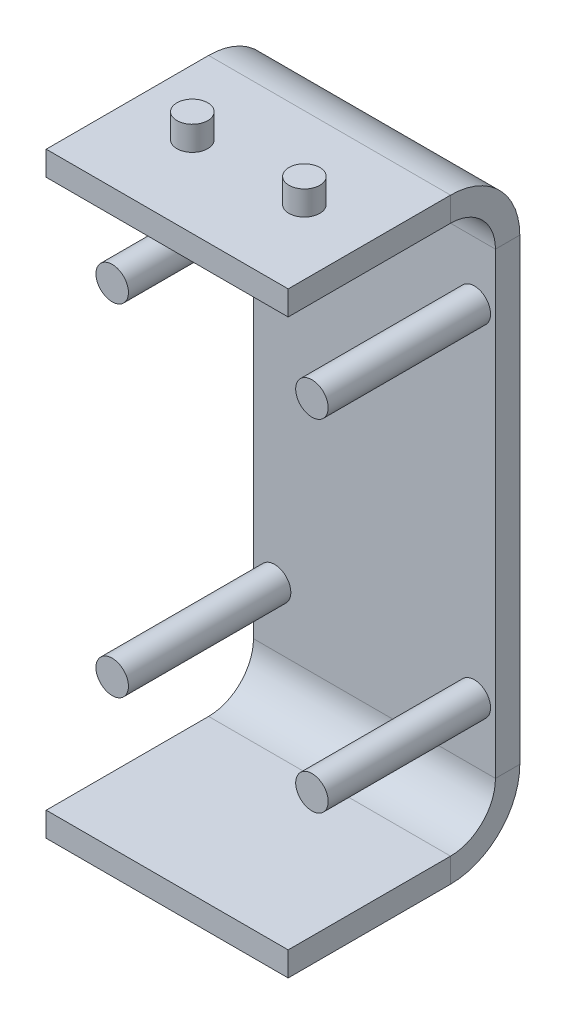
ISO-10303-21;
HEADER;
FILE_DESCRIPTION(('STEP AP214'),'2;1');
FILE_NAME('part.step','',(''),(''),'','','');
FILE_SCHEMA(('AUTOMOTIVE_DESIGN { 1 0 10303 214 1 1 1 1 }'));
ENDSEC;
DATA;
#1=APPLICATION_CONTEXT('core data for automotive mechanical design processes');
#2=APPLICATION_PROTOCOL_DEFINITION('international standard','automotive_design',2000,#1);
#3=PRODUCT_CONTEXT('',#1,'mechanical');
#4=PRODUCT('Part','Part','',(#3));
#5=PRODUCT_RELATED_PRODUCT_CATEGORY('part','',(#4));
#6=PRODUCT_DEFINITION_FORMATION('','',#4);
#7=PRODUCT_DEFINITION_CONTEXT('part definition',#1,'design');
#8=PRODUCT_DEFINITION('design','',#6,#7);
#9=PRODUCT_DEFINITION_SHAPE('','',#8);
#10=(LENGTH_UNIT() NAMED_UNIT(*) SI_UNIT(.MILLI.,.METRE.));
#11=(NAMED_UNIT(*) PLANE_ANGLE_UNIT() SI_UNIT($,.RADIAN.));
#12=(NAMED_UNIT(*) SI_UNIT($,.STERADIAN.) SOLID_ANGLE_UNIT());
#13=UNCERTAINTY_MEASURE_WITH_UNIT(LENGTH_MEASURE(1.E-05),#10,'distance_accuracy_value','');
#14=(GEOMETRIC_REPRESENTATION_CONTEXT(3) GLOBAL_UNCERTAINTY_ASSIGNED_CONTEXT((#13)) GLOBAL_UNIT_ASSIGNED_CONTEXT((#10,
#11,#12)) REPRESENTATION_CONTEXT('',''));
#15=CARTESIAN_POINT('',(0.,0.,0.));
#16=DIRECTION('',(0.,0.,1.));
#17=DIRECTION('',(1.,0.,0.));
#18=AXIS2_PLACEMENT_3D('',#15,#16,#17);
#19=CARTESIAN_POINT('',(3.45,2.25,-5.));
#20=DIRECTION('',(0.,-1.,0.));
#21=DIRECTION('',(0.,0.,-1.));
#22=AXIS2_PLACEMENT_3D('',#19,#20,#21);
#23=CYLINDRICAL_SURFACE('',#22,0.95);
#24=CARTESIAN_POINT('',(3.45,2.25,-5.));
#25=DIRECTION('',(0.,1.,0.));
#26=DIRECTION('',(0.,0.,1.));
#27=AXIS2_PLACEMENT_3D('',#24,#25,#26);
#28=CIRCLE('',#27,0.95);
#29=CARTESIAN_POINT('',(3.45,2.25,-4.05));
#30=VERTEX_POINT('',#29);
#31=EDGE_CURVE('E45',#30,#30,#28,.T.);
#32=ORIENTED_EDGE('',*,*,#31,.F.);
#33=EDGE_LOOP('',(#32));
#34=FACE_BOUND('',#33,.T.);
#35=CARTESIAN_POINT('',(3.45,0.75,-5.));
#36=DIRECTION('',(0.,1.,0.));
#37=DIRECTION('',(0.,0.,1.));
#38=AXIS2_PLACEMENT_3D('',#35,#36,#37);
#39=CIRCLE('',#38,0.95);
#40=CARTESIAN_POINT('',(3.45,0.75,-4.05));
#41=VERTEX_POINT('',#40);
#42=EDGE_CURVE('E11',#41,#41,#39,.T.);
#43=ORIENTED_EDGE('',*,*,#42,.T.);
#44=EDGE_LOOP('',(#43));
#45=FACE_BOUND('',#44,.T.);
#46=ADVANCED_FACE('F41',(#34,#45),#23,.T.);
#47=CARTESIAN_POINT('',(3.45,2.25,-5.));
#48=DIRECTION('',(0.,1.,0.));
#49=DIRECTION('',(0.,0.,1.));
#50=AXIS2_PLACEMENT_3D('',#47,#48,#49);
#51=PLANE('',#50);
#52=ORIENTED_EDGE('',*,*,#31,.T.);
#53=EDGE_LOOP('',(#52));
#54=FACE_BOUND('',#53,.T.);
#55=ADVANCED_FACE('F43',(#54),#51,.T.);
#56=CARTESIAN_POINT('',(3.45,0.75,-5.));
#57=DIRECTION('',(0.,1.,0.));
#58=DIRECTION('',(0.,0.,1.));
#59=AXIS2_PLACEMENT_3D('',#56,#57,#58);
#60=PLANE('',#59);
#61=ORIENTED_EDGE('',*,*,#42,.F.);
#62=EDGE_LOOP('',(#61));
#63=FACE_BOUND('',#62,.T.);
#64=ADVANCED_FACE('F60',(#63),#60,.F.);
#65=CLOSED_SHELL('',(#46,#55,#64));
#66=MANIFOLD_SOLID_BREP('B2',#65);
#67=CARTESIAN_POINT('',(-3.45,2.25,-5.));
#68=DIRECTION('',(0.,-1.,0.));
#69=DIRECTION('',(0.,0.,-1.));
#70=AXIS2_PLACEMENT_3D('',#67,#68,#69);
#71=CYLINDRICAL_SURFACE('',#70,0.950000000000001);
#72=CARTESIAN_POINT('',(-3.45,2.25,-5.));
#73=DIRECTION('',(0.,1.,0.));
#74=DIRECTION('',(0.,0.,1.));
#75=AXIS2_PLACEMENT_3D('',#72,#73,#74);
#76=CIRCLE('',#75,0.950000000000001);
#77=CARTESIAN_POINT('',(-3.45,2.25,-4.05));
#78=VERTEX_POINT('',#77);
#79=EDGE_CURVE('E40',#78,#78,#76,.T.);
#80=ORIENTED_EDGE('',*,*,#79,.F.);
#81=EDGE_LOOP('',(#80));
#82=FACE_BOUND('',#81,.T.);
#83=CARTESIAN_POINT('',(-3.45,0.75,-5.));
#84=DIRECTION('',(0.,1.,0.));
#85=DIRECTION('',(0.,0.,1.));
#86=AXIS2_PLACEMENT_3D('',#83,#84,#85);
#87=CIRCLE('',#86,0.950000000000001);
#88=CARTESIAN_POINT('',(-3.45,0.75,-4.05));
#89=VERTEX_POINT('',#88);
#90=EDGE_CURVE('E93',#89,#89,#87,.T.);
#91=ORIENTED_EDGE('',*,*,#90,.T.);
#92=EDGE_LOOP('',(#91));
#93=FACE_BOUND('',#92,.T.);
#94=ADVANCED_FACE('F90',(#82,#93),#71,.T.);
#95=CARTESIAN_POINT('',(-3.45,2.25,-5.));
#96=DIRECTION('',(0.,1.,0.));
#97=DIRECTION('',(0.,0.,1.));
#98=AXIS2_PLACEMENT_3D('',#95,#96,#97);
#99=PLANE('',#98);
#100=ORIENTED_EDGE('',*,*,#79,.T.);
#101=EDGE_LOOP('',(#100));
#102=FACE_BOUND('',#101,.T.);
#103=ADVANCED_FACE('F105',(#102),#99,.T.);
#104=CARTESIAN_POINT('',(-3.45,0.75,-5.));
#105=DIRECTION('',(0.,1.,0.));
#106=DIRECTION('',(0.,0.,1.));
#107=AXIS2_PLACEMENT_3D('',#104,#105,#106);
#108=PLANE('',#107);
#109=ORIENTED_EDGE('',*,*,#90,.F.);
#110=EDGE_LOOP('',(#109));
#111=FACE_BOUND('',#110,.T.);
#112=ADVANCED_FACE('F103',(#111),#108,.F.);
#113=CLOSED_SHELL('',(#94,#103,#112));
#114=MANIFOLD_SOLID_BREP('B6',#113);
#115=CARTESIAN_POINT('',(0.,-35.25,0.));
#116=DIRECTION('',(0.,0.,1.));
#117=DIRECTION('',(-1.,0.,0.));
#118=AXIS2_PLACEMENT_3D('',#115,#116,#117);
#119=PLANE('',#118);
#120=DIRECTION('',(0.,-1.,0.));
#121=VECTOR('',#120,1.);
#122=CARTESIAN_POINT('',(7.45,-34.5,0.));
#123=LINE('',#122,#121);
#124=CARTESIAN_POINT('',(7.45,-34.5,0.));
#125=VERTEX_POINT('',#124);
#126=CARTESIAN_POINT('',(7.45,-36.,0.));
#127=VERTEX_POINT('',#126);
#128=EDGE_CURVE('E239',#125,#127,#123,.T.);
#129=ORIENTED_EDGE('',*,*,#128,.F.);
#130=DIRECTION('',(1.,0.,0.));
#131=VECTOR('',#130,1.);
#132=CARTESIAN_POINT('',(-7.45,-34.5,0.));
#133=LINE('',#132,#131);
#134=CARTESIAN_POINT('',(-7.45,-34.5,0.));
#135=VERTEX_POINT('',#134);
#136=EDGE_CURVE('E241',#135,#125,#133,.T.);
#137=ORIENTED_EDGE('',*,*,#136,.F.);
#138=DIRECTION('',(0.,1.,0.));
#139=VECTOR('',#138,1.);
#140=CARTESIAN_POINT('',(-7.45,-34.5,0.));
#141=LINE('',#140,#139);
#142=CARTESIAN_POINT('',(-7.45,-36.,0.));
#143=VERTEX_POINT('',#142);
#144=EDGE_CURVE('E259',#143,#135,#141,.T.);
#145=ORIENTED_EDGE('',*,*,#144,.F.);
#146=DIRECTION('',(-1.,0.,0.));
#147=VECTOR('',#146,1.);
#148=CARTESIAN_POINT('',(-7.45,-36.,0.));
#149=LINE('',#148,#147);
#150=EDGE_CURVE('E244',#127,#143,#149,.T.);
#151=ORIENTED_EDGE('',*,*,#150,.F.);
#152=EDGE_LOOP('',(#129,#137,#145,#151));
#153=FACE_BOUND('',#152,.T.);
#154=ADVANCED_FACE('F131',(#153),#119,.T.);
#155=CARTESIAN_POINT('',(0.,0.,0.));
#156=DIRECTION('',(0.,0.,-1.));
#157=DIRECTION('',(-1.,0.,0.));
#158=AXIS2_PLACEMENT_3D('',#155,#156,#157);
#159=PLANE('',#158);
#160=DIRECTION('',(0.,1.,0.));
#161=VECTOR('',#160,1.);
#162=CARTESIAN_POINT('',(7.45,-0.75,0.));
#163=LINE('',#162,#161);
#164=CARTESIAN_POINT('',(7.45,-0.75,0.));
#165=VERTEX_POINT('',#164);
#166=CARTESIAN_POINT('',(7.45,0.75,0.));
#167=VERTEX_POINT('',#166);
#168=EDGE_CURVE('E301',#165,#167,#163,.T.);
#169=ORIENTED_EDGE('',*,*,#168,.T.);
#170=DIRECTION('',(-1.,0.,0.));
#171=VECTOR('',#170,1.);
#172=CARTESIAN_POINT('',(-7.45,0.75,0.));
#173=LINE('',#172,#171);
#174=CARTESIAN_POINT('',(-7.45,0.75,0.));
#175=VERTEX_POINT('',#174);
#176=EDGE_CURVE('E150',#167,#175,#173,.T.);
#177=ORIENTED_EDGE('',*,*,#176,.T.);
#178=DIRECTION('',(0.,-1.,0.));
#179=VECTOR('',#178,1.);
#180=CARTESIAN_POINT('',(-7.45,-0.75,0.));
#181=LINE('',#180,#179);
#182=CARTESIAN_POINT('',(-7.45,-0.75,0.));
#183=VERTEX_POINT('',#182);
#184=EDGE_CURVE('E144',#175,#183,#181,.T.);
#185=ORIENTED_EDGE('',*,*,#184,.T.);
#186=DIRECTION('',(1.,0.,0.));
#187=VECTOR('',#186,1.);
#188=CARTESIAN_POINT('',(-7.45,-0.75,0.));
#189=LINE('',#188,#187);
#190=EDGE_CURVE('E88',#183,#165,#189,.T.);
#191=ORIENTED_EDGE('',*,*,#190,.T.);
#192=EDGE_LOOP('',(#169,#177,#185,#191));
#193=FACE_BOUND('',#192,.T.);
#194=ADVANCED_FACE('F392',(#193),#159,.F.);
#195=CARTESIAN_POINT('',(7.45,-34.5,0.));
#196=DIRECTION('',(1.,0.,0.));
#197=DIRECTION('',(0.,0.,-1.));
#198=AXIS2_PLACEMENT_3D('',#195,#196,#197);
#199=PLANE('',#198);
#200=DIRECTION('',(0.,0.,-1.));
#201=VECTOR('',#200,1.);
#202=CARTESIAN_POINT('',(7.45,-36.,0.));
#203=LINE('',#202,#201);
#204=CARTESIAN_POINT('',(7.45,-36.,-10.));
#205=VERTEX_POINT('',#204);
#206=EDGE_CURVE('E266',#127,#205,#203,.T.);
#207=ORIENTED_EDGE('',*,*,#206,.T.);
#208=DIRECTION('',(0.,-1.,0.));
#209=VECTOR('',#208,1.);
#210=CARTESIAN_POINT('',(7.45,-34.5,-10.));
#211=LINE('',#210,#209);
#212=CARTESIAN_POINT('',(7.45,-34.5,-10.));
#213=VERTEX_POINT('',#212);
#214=EDGE_CURVE('E264',#213,#205,#211,.T.);
#215=ORIENTED_EDGE('',*,*,#214,.F.);
#216=DIRECTION('',(0.,0.,-1.));
#217=VECTOR('',#216,1.);
#218=CARTESIAN_POINT('',(7.45,-34.5,0.));
#219=LINE('',#218,#217);
#220=EDGE_CURVE('E256',#125,#213,#219,.T.);
#221=ORIENTED_EDGE('',*,*,#220,.F.);
#222=ORIENTED_EDGE('',*,*,#128,.T.);
#223=EDGE_LOOP('',(#207,#215,#221,#222));
#224=FACE_BOUND('',#223,.T.);
#225=ADVANCED_FACE('F262',(#224),#199,.T.);
#226=CARTESIAN_POINT('',(-7.45,-36.,0.));
#227=DIRECTION('',(0.,-1.,0.));
#228=DIRECTION('',(0.,0.,-1.));
#229=AXIS2_PLACEMENT_3D('',#226,#227,#228);
#230=PLANE('',#229);
#231=CARTESIAN_POINT('',(3.45,-36.,-5.));
#232=DIRECTION('',(0.,-1.,0.));
#233=DIRECTION('',(0.,0.,-1.));
#234=AXIS2_PLACEMENT_3D('',#231,#232,#233);
#235=CIRCLE('',#234,0.95);
#236=CARTESIAN_POINT('',(3.45,-36.,-5.95));
#237=VERTEX_POINT('',#236);
#238=EDGE_CURVE('E718',#237,#237,#235,.T.);
#239=ORIENTED_EDGE('',*,*,#238,.F.);
#240=EDGE_LOOP('',(#239));
#241=FACE_BOUND('',#240,.T.);
#242=CARTESIAN_POINT('',(-3.45,-36.,-5.));
#243=DIRECTION('',(0.,-1.,0.));
#244=DIRECTION('',(0.,0.,-1.));
#245=AXIS2_PLACEMENT_3D('',#242,#243,#244);
#246=CIRCLE('',#245,0.950000000000001);
#247=CARTESIAN_POINT('',(-3.45,-36.,-5.95));
#248=VERTEX_POINT('',#247);
#249=EDGE_CURVE('E724',#248,#248,#246,.T.);
#250=ORIENTED_EDGE('',*,*,#249,.F.);
#251=EDGE_LOOP('',(#250));
#252=FACE_BOUND('',#251,.T.);
#253=DIRECTION('',(0.,0.,-1.));
#254=VECTOR('',#253,1.);
#255=CARTESIAN_POINT('',(-7.45,-36.,0.));
#256=LINE('',#255,#254);
#257=CARTESIAN_POINT('',(-7.45,-36.,-10.));
#258=VERTEX_POINT('',#257);
#259=EDGE_CURVE('E312',#143,#258,#256,.T.);
#260=ORIENTED_EDGE('',*,*,#259,.T.);
#261=DIRECTION('',(-1.,0.,0.));
#262=VECTOR('',#261,1.);
#263=CARTESIAN_POINT('',(-7.45,-36.,-10.));
#264=LINE('',#263,#262);
#265=EDGE_CURVE('E309',#205,#258,#264,.T.);
#266=ORIENTED_EDGE('',*,*,#265,.F.);
#267=ORIENTED_EDGE('',*,*,#206,.F.);
#268=ORIENTED_EDGE('',*,*,#150,.T.);
#269=EDGE_LOOP('',(#260,#266,#267,#268));
#270=FACE_BOUND('',#269,.T.);
#271=ADVANCED_FACE('F425',(#241,#252,#270),#230,.T.);
#272=CARTESIAN_POINT('',(-7.45,-34.5,0.));
#273=DIRECTION('',(-1.,0.,0.));
#274=DIRECTION('',(0.,0.,1.));
#275=AXIS2_PLACEMENT_3D('',#272,#273,#274);
#276=PLANE('',#275);
#277=DIRECTION('',(0.,0.,-1.));
#278=VECTOR('',#277,1.);
#279=CARTESIAN_POINT('',(-7.45,-34.5,0.));
#280=LINE('',#279,#278);
#281=CARTESIAN_POINT('',(-7.45,-34.5,-10.));
#282=VERTEX_POINT('',#281);
#283=EDGE_CURVE('E258',#135,#282,#280,.T.);
#284=ORIENTED_EDGE('',*,*,#283,.T.);
#285=DIRECTION('',(0.,1.,0.));
#286=VECTOR('',#285,1.);
#287=CARTESIAN_POINT('',(-7.45,-34.5,-10.));
#288=LINE('',#287,#286);
#289=EDGE_CURVE('E315',#258,#282,#288,.T.);
#290=ORIENTED_EDGE('',*,*,#289,.F.);
#291=ORIENTED_EDGE('',*,*,#259,.F.);
#292=ORIENTED_EDGE('',*,*,#144,.T.);
#293=EDGE_LOOP('',(#284,#290,#291,#292));
#294=FACE_BOUND('',#293,.T.);
#295=ADVANCED_FACE('F377',(#294),#276,.T.);
#296=CARTESIAN_POINT('',(-7.45,-34.5,0.));
#297=DIRECTION('',(0.,1.,0.));
#298=DIRECTION('',(0.,0.,1.));
#299=AXIS2_PLACEMENT_3D('',#296,#297,#298);
#300=PLANE('',#299);
#301=DIRECTION('',(1.,0.,0.));
#302=VECTOR('',#301,1.);
#303=CARTESIAN_POINT('',(-7.45,-34.5,-10.));
#304=LINE('',#303,#302);
#305=EDGE_CURVE('E280',#282,#213,#304,.T.);
#306=ORIENTED_EDGE('',*,*,#305,.F.);
#307=ORIENTED_EDGE('',*,*,#283,.F.);
#308=ORIENTED_EDGE('',*,*,#136,.T.);
#309=ORIENTED_EDGE('',*,*,#220,.T.);
#310=EDGE_LOOP('',(#306,#307,#308,#309));
#311=FACE_BOUND('',#310,.T.);
#312=ADVANCED_FACE('F255',(#311),#300,.T.);
#313=CARTESIAN_POINT('',(7.45,-34.5,-10.));
#314=DIRECTION('',(1.,0.,0.));
#315=DIRECTION('',(0.,0.,-1.));
#316=AXIS2_PLACEMENT_3D('',#313,#314,#315);
#317=PLANE('',#316);
#318=CARTESIAN_POINT('',(7.45,-31.7363683702055,-10.));
#319=DIRECTION('',(1.,0.,0.));
#320=DIRECTION('',(0.,-1.,0.));
#321=AXIS2_PLACEMENT_3D('',#318,#319,#320);
#322=CIRCLE('',#321,4.26363162979455);
#323=CARTESIAN_POINT('',(7.45,-31.7363683702055,-14.2636316297945));
#324=VERTEX_POINT('',#323);
#325=EDGE_CURVE('E273',#205,#324,#322,.T.);
#326=ORIENTED_EDGE('',*,*,#325,.T.);
#327=DIRECTION('',(0.,0.,-1.));
#328=VECTOR('',#327,1.);
#329=CARTESIAN_POINT('',(7.45,-31.7363683702055,-12.7636316297945));
#330=LINE('',#329,#328);
#331=CARTESIAN_POINT('',(7.45,-31.7363683702055,-12.7636316297945));
#332=VERTEX_POINT('',#331);
#333=EDGE_CURVE('E270',#332,#324,#330,.T.);
#334=ORIENTED_EDGE('',*,*,#333,.F.);
#335=CARTESIAN_POINT('',(7.45,-31.7363683702055,-10.));
#336=DIRECTION('',(1.,0.,0.));
#337=DIRECTION('',(0.,-1.,0.));
#338=AXIS2_PLACEMENT_3D('',#335,#336,#337);
#339=CIRCLE('',#338,2.76363162979455);
#340=EDGE_CURVE('E274',#213,#332,#339,.T.);
#341=ORIENTED_EDGE('',*,*,#340,.F.);
#342=ORIENTED_EDGE('',*,*,#214,.T.);
#343=EDGE_LOOP('',(#326,#334,#341,#342));
#344=FACE_BOUND('',#343,.T.);
#345=ADVANCED_FACE('F373',(#344),#317,.T.);
#346=CARTESIAN_POINT('',(0.,-31.7363683702055,-10.));
#347=DIRECTION('',(1.,0.,0.));
#348=DIRECTION('',(0.,0.,-1.));
#349=AXIS2_PLACEMENT_3D('',#346,#347,#348);
#350=CYLINDRICAL_SURFACE('',#349,4.26363162979455);
#351=CARTESIAN_POINT('',(-7.45,-31.7363683702055,-10.));
#352=DIRECTION('',(1.,0.,0.));
#353=DIRECTION('',(0.,-1.,0.));
#354=AXIS2_PLACEMENT_3D('',#351,#352,#353);
#355=CIRCLE('',#354,4.26363162979455);
#356=CARTESIAN_POINT('',(-7.45,-31.7363683702055,-14.2636316297945));
#357=VERTEX_POINT('',#356);
#358=EDGE_CURVE('E318',#258,#357,#355,.T.);
#359=ORIENTED_EDGE('',*,*,#358,.T.);
#360=DIRECTION('',(-1.,0.,0.));
#361=VECTOR('',#360,1.);
#362=CARTESIAN_POINT('',(-7.45,-31.7363683702055,-14.2636316297945));
#363=LINE('',#362,#361);
#364=EDGE_CURVE('E277',#324,#357,#363,.T.);
#365=ORIENTED_EDGE('',*,*,#364,.F.);
#366=ORIENTED_EDGE('',*,*,#325,.F.);
#367=ORIENTED_EDGE('',*,*,#265,.T.);
#368=EDGE_LOOP('',(#359,#365,#366,#367));
#369=FACE_BOUND('',#368,.T.);
#370=ADVANCED_FACE('F384',(#369),#350,.T.);
#371=CARTESIAN_POINT('',(-7.45,-34.5,-10.));
#372=DIRECTION('',(-1.,0.,0.));
#373=DIRECTION('',(0.,0.,1.));
#374=AXIS2_PLACEMENT_3D('',#371,#372,#373);
#375=PLANE('',#374);
#376=CARTESIAN_POINT('',(-7.45,-31.7363683702055,-10.));
#377=DIRECTION('',(1.,0.,0.));
#378=DIRECTION('',(0.,-1.,0.));
#379=AXIS2_PLACEMENT_3D('',#376,#377,#378);
#380=CIRCLE('',#379,2.76363162979455);
#381=CARTESIAN_POINT('',(-7.45,-31.7363683702055,-12.7636316297945));
#382=VERTEX_POINT('',#381);
#383=EDGE_CURVE('E338',#282,#382,#380,.T.);
#384=ORIENTED_EDGE('',*,*,#383,.T.);
#385=DIRECTION('',(0.,0.,1.));
#386=VECTOR('',#385,1.);
#387=CARTESIAN_POINT('',(-7.45,-31.7363683702055,-12.7636316297945));
#388=LINE('',#387,#386);
#389=EDGE_CURVE('E321',#357,#382,#388,.T.);
#390=ORIENTED_EDGE('',*,*,#389,.F.);
#391=ORIENTED_EDGE('',*,*,#358,.F.);
#392=ORIENTED_EDGE('',*,*,#289,.T.);
#393=EDGE_LOOP('',(#384,#390,#391,#392));
#394=FACE_BOUND('',#393,.T.);
#395=ADVANCED_FACE('F380',(#394),#375,.T.);
#396=CARTESIAN_POINT('',(0.,-31.7363683702055,-10.));
#397=DIRECTION('',(1.,0.,0.));
#398=DIRECTION('',(0.,0.,-1.));
#399=AXIS2_PLACEMENT_3D('',#396,#397,#398);
#400=CYLINDRICAL_SURFACE('',#399,2.76363162979455);
#401=DIRECTION('',(1.,0.,0.));
#402=VECTOR('',#401,1.);
#403=CARTESIAN_POINT('',(-7.45,-31.7363683702055,-12.7636316297945));
#404=LINE('',#403,#402);
#405=EDGE_CURVE('E291',#382,#332,#404,.T.);
#406=ORIENTED_EDGE('',*,*,#405,.F.);
#407=ORIENTED_EDGE('',*,*,#383,.F.);
#408=ORIENTED_EDGE('',*,*,#305,.T.);
#409=ORIENTED_EDGE('',*,*,#340,.T.);
#410=EDGE_LOOP('',(#406,#407,#408,#409));
#411=FACE_BOUND('',#410,.T.);
#412=ADVANCED_FACE('F374',(#411),#400,.F.);
#413=CARTESIAN_POINT('',(7.45,-31.7363683702055,-12.7636316297945));
#414=DIRECTION('',(1.,0.,0.));
#415=DIRECTION('',(0.,0.,-1.));
#416=AXIS2_PLACEMENT_3D('',#413,#414,#415);
#417=PLANE('',#416);
#418=DIRECTION('',(0.,1.,0.));
#419=VECTOR('',#418,1.);
#420=CARTESIAN_POINT('',(7.45,-31.7363683702055,-14.2636316297945));
#421=LINE('',#420,#419);
#422=CARTESIAN_POINT('',(7.45,-3.51363162979455,-14.2636316297946));
#423=VERTEX_POINT('',#422);
#424=EDGE_CURVE('E284',#324,#423,#421,.T.);
#425=ORIENTED_EDGE('',*,*,#424,.T.);
#426=DIRECTION('',(0.,0.,-1.));
#427=VECTOR('',#426,1.);
#428=CARTESIAN_POINT('',(7.45,-3.51363162979455,-12.7636316297945));
#429=LINE('',#428,#427);
#430=CARTESIAN_POINT('',(7.45,-3.51363162979455,-12.7636316297945));
#431=VERTEX_POINT('',#430);
#432=EDGE_CURVE('E281',#431,#423,#429,.T.);
#433=ORIENTED_EDGE('',*,*,#432,.F.);
#434=DIRECTION('',(0.,1.,0.));
#435=VECTOR('',#434,1.);
#436=CARTESIAN_POINT('',(7.45,-31.7363683702055,-12.7636316297945));
#437=LINE('',#436,#435);
#438=EDGE_CURVE('E285',#332,#431,#437,.T.);
#439=ORIENTED_EDGE('',*,*,#438,.F.);
#440=ORIENTED_EDGE('',*,*,#333,.T.);
#441=EDGE_LOOP('',(#425,#433,#439,#440));
#442=FACE_BOUND('',#441,.T.);
#443=ADVANCED_FACE('F367',(#442),#417,.T.);
#444=CARTESIAN_POINT('',(-7.45,-31.7363683702055,-14.2636316297945));
#445=DIRECTION('',(0.,0.,-1.));
#446=DIRECTION('',(0.,1.,0.));
#447=AXIS2_PLACEMENT_3D('',#444,#445,#446);
#448=PLANE('',#447);
#449=DIRECTION('',(0.,1.,0.));
#450=VECTOR('',#449,1.);
#451=CARTESIAN_POINT('',(-7.45,-31.7363683702055,-14.2636316297945));
#452=LINE('',#451,#450);
#453=CARTESIAN_POINT('',(-7.45,-3.51363162979455,-14.2636316297946));
#454=VERTEX_POINT('',#453);
#455=EDGE_CURVE('E323',#357,#454,#452,.T.);
#456=ORIENTED_EDGE('',*,*,#455,.T.);
#457=DIRECTION('',(-1.,0.,0.));
#458=VECTOR('',#457,1.);
#459=CARTESIAN_POINT('',(-7.45,-3.51363162979455,-14.2636316297946));
#460=LINE('',#459,#458);
#461=EDGE_CURVE('E288',#423,#454,#460,.T.);
#462=ORIENTED_EDGE('',*,*,#461,.F.);
#463=ORIENTED_EDGE('',*,*,#424,.F.);
#464=ORIENTED_EDGE('',*,*,#364,.T.);
#465=EDGE_LOOP('',(#456,#462,#463,#464));
#466=FACE_BOUND('',#465,.T.);
#467=ADVANCED_FACE('F387',(#466),#448,.T.);
#468=CARTESIAN_POINT('',(-7.45,-31.7363683702055,-12.7636316297945));
#469=DIRECTION('',(-1.,0.,0.));
#470=DIRECTION('',(0.,0.,1.));
#471=AXIS2_PLACEMENT_3D('',#468,#469,#470);
#472=PLANE('',#471);
#473=DIRECTION('',(0.,1.,0.));
#474=VECTOR('',#473,1.);
#475=CARTESIAN_POINT('',(-7.45,-31.7363683702055,-12.7636316297945));
#476=LINE('',#475,#474);
#477=CARTESIAN_POINT('',(-7.45,-3.51363162979455,-12.7636316297945));
#478=VERTEX_POINT('',#477);
#479=EDGE_CURVE('E342',#382,#478,#476,.T.);
#480=ORIENTED_EDGE('',*,*,#479,.T.);
#481=DIRECTION('',(0.,0.,1.));
#482=VECTOR('',#481,1.);
#483=CARTESIAN_POINT('',(-7.45,-3.51363162979455,-12.7636316297945));
#484=LINE('',#483,#482);
#485=EDGE_CURVE('E326',#454,#478,#484,.T.);
#486=ORIENTED_EDGE('',*,*,#485,.F.);
#487=ORIENTED_EDGE('',*,*,#455,.F.);
#488=ORIENTED_EDGE('',*,*,#389,.T.);
#489=EDGE_LOOP('',(#480,#486,#487,#488));
#490=FACE_BOUND('',#489,.T.);
#491=ADVANCED_FACE('F396',(#490),#472,.T.);
#492=CARTESIAN_POINT('',(-7.45,-31.7363683702055,-12.7636316297945));
#493=DIRECTION('',(0.,0.,1.));
#494=DIRECTION('',(0.,-1.,0.));
#495=AXIS2_PLACEMENT_3D('',#492,#493,#494);
#496=PLANE('',#495);
#497=CARTESIAN_POINT('',(6.15,-28.125,-12.7636316297945));
#498=DIRECTION('',(0.,0.,1.));
#499=DIRECTION('',(1.,0.,0.));
#500=AXIS2_PLACEMENT_3D('',#497,#498,#499);
#501=CIRCLE('',#500,0.999999999999999);
#502=CARTESIAN_POINT('',(7.15,-28.125,-12.7636316297945));
#503=VERTEX_POINT('',#502);
#504=EDGE_CURVE('E698',#503,#503,#501,.T.);
#505=ORIENTED_EDGE('',*,*,#504,.F.);
#506=EDGE_LOOP('',(#505));
#507=FACE_BOUND('',#506,.T.);
#508=CARTESIAN_POINT('',(6.15,-7.125,-12.7636316297945));
#509=DIRECTION('',(0.,0.,1.));
#510=DIRECTION('',(1.,0.,0.));
#511=AXIS2_PLACEMENT_3D('',#508,#509,#510);
#512=CIRCLE('',#511,0.999999999999998);
#513=CARTESIAN_POINT('',(7.15,-7.125,-12.7636316297945));
#514=VERTEX_POINT('',#513);
#515=EDGE_CURVE('E697',#514,#514,#512,.T.);
#516=ORIENTED_EDGE('',*,*,#515,.F.);
#517=EDGE_LOOP('',(#516));
#518=FACE_BOUND('',#517,.T.);
#519=CARTESIAN_POINT('',(-6.15,-7.125,-12.7636316297945));
#520=DIRECTION('',(0.,0.,1.));
#521=DIRECTION('',(1.,0.,0.));
#522=AXIS2_PLACEMENT_3D('',#519,#520,#521);
#523=CIRCLE('',#522,1.);
#524=CARTESIAN_POINT('',(-5.15,-7.125,-12.7636316297945));
#525=VERTEX_POINT('',#524);
#526=EDGE_CURVE('E707',#525,#525,#523,.T.);
#527=ORIENTED_EDGE('',*,*,#526,.F.);
#528=EDGE_LOOP('',(#527));
#529=FACE_BOUND('',#528,.T.);
#530=CARTESIAN_POINT('',(-6.15,-28.125,-12.7636316297945));
#531=DIRECTION('',(0.,0.,1.));
#532=DIRECTION('',(1.,0.,0.));
#533=AXIS2_PLACEMENT_3D('',#530,#531,#532);
#534=CIRCLE('',#533,1.);
#535=CARTESIAN_POINT('',(-5.15,-28.125,-12.7636316297945));
#536=VERTEX_POINT('',#535);
#537=EDGE_CURVE('E712',#536,#536,#534,.T.);
#538=ORIENTED_EDGE('',*,*,#537,.F.);
#539=EDGE_LOOP('',(#538));
#540=FACE_BOUND('',#539,.T.);
#541=DIRECTION('',(1.,0.,0.));
#542=VECTOR('',#541,1.);
#543=CARTESIAN_POINT('',(-7.45,-3.51363162979455,-12.7636316297945));
#544=LINE('',#543,#542);
#545=EDGE_CURVE('E300',#478,#431,#544,.T.);
#546=ORIENTED_EDGE('',*,*,#545,.F.);
#547=ORIENTED_EDGE('',*,*,#479,.F.);
#548=ORIENTED_EDGE('',*,*,#405,.T.);
#549=ORIENTED_EDGE('',*,*,#438,.T.);
#550=EDGE_LOOP('',(#546,#547,#548,#549));
#551=FACE_BOUND('',#550,.T.);
#552=ADVANCED_FACE('F368',(#507,#518,#529,#540,#551),#496,.T.);
#553=CARTESIAN_POINT('',(7.45,-3.51363162979455,-12.7636316297945));
#554=DIRECTION('',(1.,0.,0.));
#555=DIRECTION('',(0.,0.,-1.));
#556=AXIS2_PLACEMENT_3D('',#553,#554,#555);
#557=PLANE('',#556);
#558=CARTESIAN_POINT('',(7.45,-3.51363162979455,-10.));
#559=DIRECTION('',(1.,0.,0.));
#560=DIRECTION('',(0.,0.,-1.));
#561=AXIS2_PLACEMENT_3D('',#558,#559,#560);
#562=CIRCLE('',#561,4.26363162979455);
#563=CARTESIAN_POINT('',(7.45,0.75,-10.));
#564=VERTEX_POINT('',#563);
#565=EDGE_CURVE('E220',#423,#564,#562,.T.);
#566=ORIENTED_EDGE('',*,*,#565,.T.);
#567=DIRECTION('',(0.,1.,0.));
#568=VECTOR('',#567,1.);
#569=CARTESIAN_POINT('',(7.45,-0.75,-10.));
#570=LINE('',#569,#568);
#571=CARTESIAN_POINT('',(7.45,-0.750000000000001,-10.));
#572=VERTEX_POINT('',#571);
#573=EDGE_CURVE('E292',#572,#564,#570,.T.);
#574=ORIENTED_EDGE('',*,*,#573,.F.);
#575=CARTESIAN_POINT('',(7.45,-3.51363162979455,-10.));
#576=DIRECTION('',(1.,0.,0.));
#577=DIRECTION('',(0.,0.,-1.));
#578=AXIS2_PLACEMENT_3D('',#575,#576,#577);
#579=CIRCLE('',#578,2.76363162979455);
#580=EDGE_CURVE('E295',#431,#572,#579,.T.);
#581=ORIENTED_EDGE('',*,*,#580,.F.);
#582=ORIENTED_EDGE('',*,*,#432,.T.);
#583=EDGE_LOOP('',(#566,#574,#581,#582));
#584=FACE_BOUND('',#583,.T.);
#585=ADVANCED_FACE('F360',(#584),#557,.T.);
#586=CARTESIAN_POINT('',(0.,-3.51363162979455,-10.));
#587=DIRECTION('',(1.,0.,0.));
#588=DIRECTION('',(0.,0.,-1.));
#589=AXIS2_PLACEMENT_3D('',#586,#587,#588);
#590=CYLINDRICAL_SURFACE('',#589,4.26363162979455);
#591=CARTESIAN_POINT('',(-7.45,-3.51363162979455,-10.));
#592=DIRECTION('',(1.,0.,0.));
#593=DIRECTION('',(0.,0.,-1.));
#594=AXIS2_PLACEMENT_3D('',#591,#592,#593);
#595=CIRCLE('',#594,4.26363162979455);
#596=CARTESIAN_POINT('',(-7.45,0.75,-10.));
#597=VERTEX_POINT('',#596);
#598=EDGE_CURVE('E214',#454,#597,#595,.T.);
#599=ORIENTED_EDGE('',*,*,#598,.T.);
#600=DIRECTION('',(-1.,0.,0.));
#601=VECTOR('',#600,1.);
#602=CARTESIAN_POINT('',(-7.45,0.75,-10.));
#603=LINE('',#602,#601);
#604=EDGE_CURVE('E297',#564,#597,#603,.T.);
#605=ORIENTED_EDGE('',*,*,#604,.F.);
#606=ORIENTED_EDGE('',*,*,#565,.F.);
#607=ORIENTED_EDGE('',*,*,#461,.T.);
#608=EDGE_LOOP('',(#599,#605,#606,#607));
#609=FACE_BOUND('',#608,.T.);
#610=ADVANCED_FACE('F388',(#609),#590,.T.);
#611=CARTESIAN_POINT('',(-7.45,-3.51363162979455,-12.7636316297945));
#612=DIRECTION('',(-1.,0.,0.));
#613=DIRECTION('',(0.,0.,1.));
#614=AXIS2_PLACEMENT_3D('',#611,#612,#613);
#615=PLANE('',#614);
#616=CARTESIAN_POINT('',(-7.45,-3.51363162979455,-10.));
#617=DIRECTION('',(1.,0.,0.));
#618=DIRECTION('',(0.,0.,-1.));
#619=AXIS2_PLACEMENT_3D('',#616,#617,#618);
#620=CIRCLE('',#619,2.76363162979455);
#621=CARTESIAN_POINT('',(-7.45,-0.750000000000001,-10.));
#622=VERTEX_POINT('',#621);
#623=EDGE_CURVE('E346',#478,#622,#620,.T.);
#624=ORIENTED_EDGE('',*,*,#623,.T.);
#625=DIRECTION('',(0.,-1.,0.));
#626=VECTOR('',#625,1.);
#627=CARTESIAN_POINT('',(-7.45,-0.75,-10.));
#628=LINE('',#627,#626);
#629=EDGE_CURVE('E329',#597,#622,#628,.T.);
#630=ORIENTED_EDGE('',*,*,#629,.F.);
#631=ORIENTED_EDGE('',*,*,#598,.F.);
#632=ORIENTED_EDGE('',*,*,#485,.T.);
#633=EDGE_LOOP('',(#624,#630,#631,#632));
#634=FACE_BOUND('',#633,.T.);
#635=ADVANCED_FACE('F394',(#634),#615,.T.);
#636=CARTESIAN_POINT('',(0.,-3.51363162979455,-10.));
#637=DIRECTION('',(1.,0.,0.));
#638=DIRECTION('',(0.,0.,-1.));
#639=AXIS2_PLACEMENT_3D('',#636,#637,#638);
#640=CYLINDRICAL_SURFACE('',#639,2.76363162979455);
#641=DIRECTION('',(1.,0.,0.));
#642=VECTOR('',#641,1.);
#643=CARTESIAN_POINT('',(-7.45,-0.75,-10.));
#644=LINE('',#643,#642);
#645=EDGE_CURVE('E307',#622,#572,#644,.T.);
#646=ORIENTED_EDGE('',*,*,#645,.F.);
#647=ORIENTED_EDGE('',*,*,#623,.F.);
#648=ORIENTED_EDGE('',*,*,#545,.T.);
#649=ORIENTED_EDGE('',*,*,#580,.T.);
#650=EDGE_LOOP('',(#646,#647,#648,#649));
#651=FACE_BOUND('',#650,.T.);
#652=ADVANCED_FACE('F362',(#651),#640,.F.);
#653=CARTESIAN_POINT('',(7.45,-0.75,-10.));
#654=DIRECTION('',(1.,0.,0.));
#655=DIRECTION('',(0.,0.,-1.));
#656=AXIS2_PLACEMENT_3D('',#653,#654,#655);
#657=PLANE('',#656);
#658=DIRECTION('',(0.,0.,1.));
#659=VECTOR('',#658,1.);
#660=CARTESIAN_POINT('',(7.45,0.75,-10.));
#661=LINE('',#660,#659);
#662=EDGE_CURVE('E195',#564,#167,#661,.T.);
#663=ORIENTED_EDGE('',*,*,#662,.T.);
#664=ORIENTED_EDGE('',*,*,#168,.F.);
#665=DIRECTION('',(0.,0.,1.));
#666=VECTOR('',#665,1.);
#667=CARTESIAN_POINT('',(7.45,-0.75,-10.));
#668=LINE('',#667,#666);
#669=EDGE_CURVE('E303',#572,#165,#668,.T.);
#670=ORIENTED_EDGE('',*,*,#669,.F.);
#671=ORIENTED_EDGE('',*,*,#573,.T.);
#672=EDGE_LOOP('',(#663,#664,#670,#671));
#673=FACE_BOUND('',#672,.T.);
#674=ADVANCED_FACE('F391',(#673),#657,.T.);
#675=CARTESIAN_POINT('',(-7.45,0.75,-10.));
#676=DIRECTION('',(0.,1.,0.));
#677=DIRECTION('',(0.,0.,1.));
#678=AXIS2_PLACEMENT_3D('',#675,#676,#677);
#679=PLANE('',#678);
#680=DIRECTION('',(0.,0.,1.));
#681=VECTOR('',#680,1.);
#682=CARTESIAN_POINT('',(-7.45,0.75,-10.));
#683=LINE('',#682,#681);
#684=EDGE_CURVE('E188',#597,#175,#683,.T.);
#685=ORIENTED_EDGE('',*,*,#684,.T.);
#686=ORIENTED_EDGE('',*,*,#176,.F.);
#687=ORIENTED_EDGE('',*,*,#662,.F.);
#688=ORIENTED_EDGE('',*,*,#604,.T.);
#689=EDGE_LOOP('',(#685,#686,#687,#688));
#690=FACE_BOUND('',#689,.T.);
#691=ADVANCED_FACE('F389',(#690),#679,.T.);
#692=CARTESIAN_POINT('',(-7.45,-0.75,-10.));
#693=DIRECTION('',(-1.,0.,0.));
#694=DIRECTION('',(0.,0.,1.));
#695=AXIS2_PLACEMENT_3D('',#692,#693,#694);
#696=PLANE('',#695);
#697=DIRECTION('',(0.,0.,1.));
#698=VECTOR('',#697,1.);
#699=CARTESIAN_POINT('',(-7.45,-0.75,-10.));
#700=LINE('',#699,#698);
#701=EDGE_CURVE('E138',#622,#183,#700,.T.);
#702=ORIENTED_EDGE('',*,*,#701,.T.);
#703=ORIENTED_EDGE('',*,*,#184,.F.);
#704=ORIENTED_EDGE('',*,*,#684,.F.);
#705=ORIENTED_EDGE('',*,*,#629,.T.);
#706=EDGE_LOOP('',(#702,#703,#704,#705));
#707=FACE_BOUND('',#706,.T.);
#708=ADVANCED_FACE('F393',(#707),#696,.T.);
#709=CARTESIAN_POINT('',(-7.45,-0.75,-10.));
#710=DIRECTION('',(0.,-1.,0.));
#711=DIRECTION('',(0.,0.,-1.));
#712=AXIS2_PLACEMENT_3D('',#709,#710,#711);
#713=PLANE('',#712);
#714=ORIENTED_EDGE('',*,*,#190,.F.);
#715=ORIENTED_EDGE('',*,*,#701,.F.);
#716=ORIENTED_EDGE('',*,*,#645,.T.);
#717=ORIENTED_EDGE('',*,*,#669,.T.);
#718=EDGE_LOOP('',(#714,#715,#716,#717));
#719=FACE_BOUND('',#718,.T.);
#720=ADVANCED_FACE('F357',(#719),#713,.T.);
#721=CARTESIAN_POINT('',(-3.45,-37.5,-5.));
#722=DIRECTION('',(0.,1.,0.));
#723=DIRECTION('',(0.,0.,1.));
#724=AXIS2_PLACEMENT_3D('',#721,#722,#723);
#725=CYLINDRICAL_SURFACE('',#724,0.950000000000001);
#726=CARTESIAN_POINT('',(-3.45,-37.5,-5.));
#727=DIRECTION('',(0.,-1.,0.));
#728=DIRECTION('',(0.,0.,-1.));
#729=AXIS2_PLACEMENT_3D('',#726,#727,#728);
#730=CIRCLE('',#729,0.950000000000001);
#731=CARTESIAN_POINT('',(-3.45,-37.5,-5.95));
#732=VERTEX_POINT('',#731);
#733=EDGE_CURVE('E249',#732,#732,#730,.T.);
#734=ORIENTED_EDGE('',*,*,#733,.F.);
#735=EDGE_LOOP('',(#734));
#736=FACE_BOUND('',#735,.T.);
#737=ORIENTED_EDGE('',*,*,#249,.T.);
#738=EDGE_LOOP('',(#737));
#739=FACE_BOUND('',#738,.T.);
#740=ADVANCED_FACE('F409',(#736,#739),#725,.T.);
#741=CARTESIAN_POINT('',(-3.45,-37.5,-5.));
#742=DIRECTION('',(0.,-1.,0.));
#743=DIRECTION('',(0.,0.,-1.));
#744=AXIS2_PLACEMENT_3D('',#741,#742,#743);
#745=PLANE('',#744);
#746=ORIENTED_EDGE('',*,*,#733,.T.);
#747=EDGE_LOOP('',(#746));
#748=FACE_BOUND('',#747,.T.);
#749=ADVANCED_FACE('F415',(#748),#745,.T.);
#750=CARTESIAN_POINT('',(3.45,-37.5,-5.));
#751=DIRECTION('',(0.,1.,0.));
#752=DIRECTION('',(0.,0.,1.));
#753=AXIS2_PLACEMENT_3D('',#750,#751,#752);
#754=CYLINDRICAL_SURFACE('',#753,0.95);
#755=CARTESIAN_POINT('',(3.45,-37.5,-5.));
#756=DIRECTION('',(0.,-1.,0.));
#757=DIRECTION('',(0.,0.,-1.));
#758=AXIS2_PLACEMENT_3D('',#755,#756,#757);
#759=CIRCLE('',#758,0.95);
#760=CARTESIAN_POINT('',(3.45,-37.5,-5.95));
#761=VERTEX_POINT('',#760);
#762=EDGE_CURVE('E721',#761,#761,#759,.T.);
#763=ORIENTED_EDGE('',*,*,#762,.F.);
#764=EDGE_LOOP('',(#763));
#765=FACE_BOUND('',#764,.T.);
#766=ORIENTED_EDGE('',*,*,#238,.T.);
#767=EDGE_LOOP('',(#766));
#768=FACE_BOUND('',#767,.T.);
#769=ADVANCED_FACE('F585',(#765,#768),#754,.T.);
#770=CARTESIAN_POINT('',(3.45,-37.5,-5.));
#771=DIRECTION('',(0.,-1.,0.));
#772=DIRECTION('',(0.,0.,-1.));
#773=AXIS2_PLACEMENT_3D('',#770,#771,#772);
#774=PLANE('',#773);
#775=ORIENTED_EDGE('',*,*,#762,.T.);
#776=EDGE_LOOP('',(#775));
#777=FACE_BOUND('',#776,.T.);
#778=ADVANCED_FACE('F595',(#777),#774,.T.);
#779=CARTESIAN_POINT('',(-6.15,-28.125,-2.76363162979455));
#780=DIRECTION('',(0.,0.,-1.));
#781=DIRECTION('',(-1.,0.,0.));
#782=AXIS2_PLACEMENT_3D('',#779,#780,#781);
#783=CYLINDRICAL_SURFACE('',#782,1.);
#784=CARTESIAN_POINT('',(-6.15,-28.125,-2.76363162979455));
#785=DIRECTION('',(0.,0.,1.));
#786=DIRECTION('',(1.,0.,0.));
#787=AXIS2_PLACEMENT_3D('',#784,#785,#786);
#788=CIRCLE('',#787,1.);
#789=CARTESIAN_POINT('',(-5.15,-28.125,-2.76363162979455));
#790=VERTEX_POINT('',#789);
#791=EDGE_CURVE('E715',#790,#790,#788,.T.);
#792=ORIENTED_EDGE('',*,*,#791,.F.);
#793=EDGE_LOOP('',(#792));
#794=FACE_BOUND('',#793,.T.);
#795=ORIENTED_EDGE('',*,*,#537,.T.);
#796=EDGE_LOOP('',(#795));
#797=FACE_BOUND('',#796,.T.);
#798=ADVANCED_FACE('F605',(#794,#797),#783,.T.);
#799=CARTESIAN_POINT('',(-6.15,-28.125,-2.76363162979455));
#800=DIRECTION('',(0.,0.,1.));
#801=DIRECTION('',(1.,0.,0.));
#802=AXIS2_PLACEMENT_3D('',#799,#800,#801);
#803=PLANE('',#802);
#804=ORIENTED_EDGE('',*,*,#791,.T.);
#805=EDGE_LOOP('',(#804));
#806=FACE_BOUND('',#805,.T.);
#807=ADVANCED_FACE('F620',(#806),#803,.T.);
#808=CARTESIAN_POINT('',(-6.15,-7.125,-2.76363162979455));
#809=DIRECTION('',(0.,0.,-1.));
#810=DIRECTION('',(-1.,0.,0.));
#811=AXIS2_PLACEMENT_3D('',#808,#809,#810);
#812=CYLINDRICAL_SURFACE('',#811,1.);
#813=CARTESIAN_POINT('',(-6.15,-7.125,-2.76363162979455));
#814=DIRECTION('',(0.,0.,1.));
#815=DIRECTION('',(1.,0.,0.));
#816=AXIS2_PLACEMENT_3D('',#813,#814,#815);
#817=CIRCLE('',#816,1.);
#818=CARTESIAN_POINT('',(-5.15,-7.125,-2.76363162979455));
#819=VERTEX_POINT('',#818);
#820=EDGE_CURVE('E709',#819,#819,#817,.T.);
#821=ORIENTED_EDGE('',*,*,#820,.F.);
#822=EDGE_LOOP('',(#821));
#823=FACE_BOUND('',#822,.T.);
#824=ORIENTED_EDGE('',*,*,#526,.T.);
#825=EDGE_LOOP('',(#824));
#826=FACE_BOUND('',#825,.T.);
#827=ADVANCED_FACE('F630',(#823,#826),#812,.T.);
#828=CARTESIAN_POINT('',(-6.15,-7.125,-2.76363162979455));
#829=DIRECTION('',(0.,0.,1.));
#830=DIRECTION('',(1.,0.,0.));
#831=AXIS2_PLACEMENT_3D('',#828,#829,#830);
#832=PLANE('',#831);
#833=ORIENTED_EDGE('',*,*,#820,.T.);
#834=EDGE_LOOP('',(#833));
#835=FACE_BOUND('',#834,.T.);
#836=ADVANCED_FACE('F640',(#835),#832,.T.);
#837=CARTESIAN_POINT('',(6.15,-7.125,-2.76363162979455));
#838=DIRECTION('',(0.,0.,-1.));
#839=DIRECTION('',(-1.,0.,0.));
#840=AXIS2_PLACEMENT_3D('',#837,#838,#839);
#841=CYLINDRICAL_SURFACE('',#840,0.999999999999998);
#842=CARTESIAN_POINT('',(6.15,-7.125,-2.76363162979455));
#843=DIRECTION('',(0.,0.,1.));
#844=DIRECTION('',(1.,0.,0.));
#845=AXIS2_PLACEMENT_3D('',#842,#843,#844);
#846=CIRCLE('',#845,0.999999999999998);
#847=CARTESIAN_POINT('',(7.15,-7.125,-2.76363162979455));
#848=VERTEX_POINT('',#847);
#849=EDGE_CURVE('E701',#848,#848,#846,.T.);
#850=ORIENTED_EDGE('',*,*,#849,.F.);
#851=EDGE_LOOP('',(#850));
#852=FACE_BOUND('',#851,.T.);
#853=ORIENTED_EDGE('',*,*,#515,.T.);
#854=EDGE_LOOP('',(#853));
#855=FACE_BOUND('',#854,.T.);
#856=ADVANCED_FACE('F650',(#852,#855),#841,.T.);
#857=CARTESIAN_POINT('',(6.15,-7.125,-2.76363162979455));
#858=DIRECTION('',(0.,0.,1.));
#859=DIRECTION('',(1.,0.,0.));
#860=AXIS2_PLACEMENT_3D('',#857,#858,#859);
#861=PLANE('',#860);
#862=ORIENTED_EDGE('',*,*,#849,.T.);
#863=EDGE_LOOP('',(#862));
#864=FACE_BOUND('',#863,.T.);
#865=ADVANCED_FACE('F660',(#864),#861,.T.);
#866=CARTESIAN_POINT('',(6.15,-28.125,-2.76363162979455));
#867=DIRECTION('',(0.,0.,-1.));
#868=DIRECTION('',(-1.,0.,0.));
#869=AXIS2_PLACEMENT_3D('',#866,#867,#868);
#870=CYLINDRICAL_SURFACE('',#869,0.999999999999999);
#871=CARTESIAN_POINT('',(6.15,-28.125,-2.76363162979455));
#872=DIRECTION('',(0.,0.,1.));
#873=DIRECTION('',(1.,0.,0.));
#874=AXIS2_PLACEMENT_3D('',#871,#872,#873);
#875=CIRCLE('',#874,0.999999999999999);
#876=CARTESIAN_POINT('',(7.15,-28.125,-2.76363162979455));
#877=VERTEX_POINT('',#876);
#878=EDGE_CURVE('E696',#877,#877,#875,.T.);
#879=ORIENTED_EDGE('',*,*,#878,.F.);
#880=EDGE_LOOP('',(#879));
#881=FACE_BOUND('',#880,.T.);
#882=ORIENTED_EDGE('',*,*,#504,.T.);
#883=EDGE_LOOP('',(#882));
#884=FACE_BOUND('',#883,.T.);
#885=ADVANCED_FACE('F670',(#881,#884),#870,.T.);
#886=CARTESIAN_POINT('',(6.15,-28.125,-2.76363162979455));
#887=DIRECTION('',(0.,0.,1.));
#888=DIRECTION('',(1.,0.,0.));
#889=AXIS2_PLACEMENT_3D('',#886,#887,#888);
#890=PLANE('',#889);
#891=ORIENTED_EDGE('',*,*,#878,.T.);
#892=EDGE_LOOP('',(#891));
#893=FACE_BOUND('',#892,.T.);
#894=ADVANCED_FACE('F680',(#893),#890,.T.);
#895=CLOSED_SHELL('',(#154,#194,#225,#271,#295,#312,#345,#370,#395,#412,#443,#467,#491,#552,
#585,#610,#635,#652,#674,#691,#708,#720,#740,#749,#769,#778,#798,#807,#827,#836,#856,#865,#885,#894));
#896=MANIFOLD_SOLID_BREP('B35',#895);
#897=ADVANCED_BREP_SHAPE_REPRESENTATION('',(#18,#66,#114,#896),#14);
#898=SHAPE_DEFINITION_REPRESENTATION(#9,#897);
ENDSEC;
END-ISO-10303-21;
